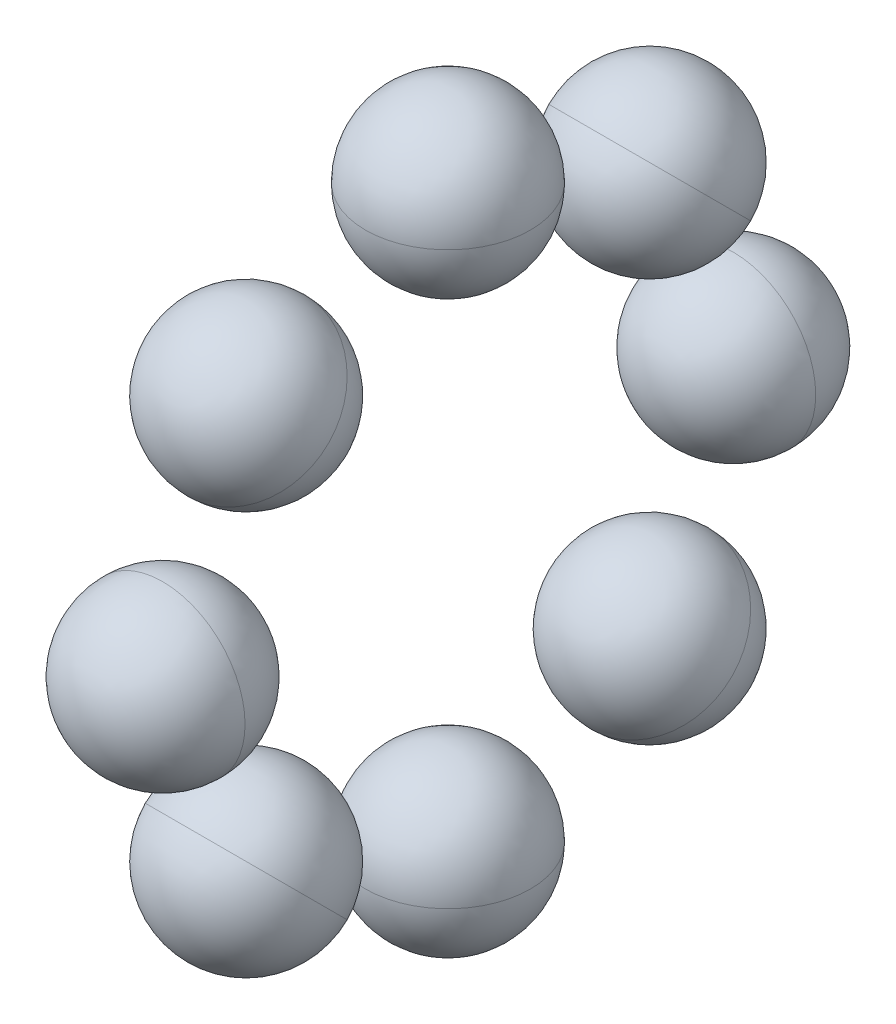
ISO-10303-21;
HEADER;
FILE_DESCRIPTION(('STEP AP214'),'2;1');
FILE_NAME('part.step','',(''),(''),'','','');
FILE_SCHEMA(('AUTOMOTIVE_DESIGN { 1 0 10303 214 1 1 1 1 }'));
ENDSEC;
DATA;
#1=APPLICATION_CONTEXT('core data for automotive mechanical design processes');
#2=APPLICATION_PROTOCOL_DEFINITION('international standard','automotive_design',2000,#1);
#3=PRODUCT_CONTEXT('',#1,'mechanical');
#4=PRODUCT('Part','Part','',(#3));
#5=PRODUCT_RELATED_PRODUCT_CATEGORY('part','',(#4));
#6=PRODUCT_DEFINITION_FORMATION('','',#4);
#7=PRODUCT_DEFINITION_CONTEXT('part definition',#1,'design');
#8=PRODUCT_DEFINITION('design','',#6,#7);
#9=PRODUCT_DEFINITION_SHAPE('','',#8);
#10=(LENGTH_UNIT() NAMED_UNIT(*) SI_UNIT(.MILLI.,.METRE.));
#11=(NAMED_UNIT(*) PLANE_ANGLE_UNIT() SI_UNIT($,.RADIAN.));
#12=(NAMED_UNIT(*) SI_UNIT($,.STERADIAN.) SOLID_ANGLE_UNIT());
#13=UNCERTAINTY_MEASURE_WITH_UNIT(LENGTH_MEASURE(1.E-05),#10,'distance_accuracy_value','');
#14=(GEOMETRIC_REPRESENTATION_CONTEXT(3) GLOBAL_UNCERTAINTY_ASSIGNED_CONTEXT((#13)) GLOBAL_UNIT_ASSIGNED_CONTEXT((#10,
#11,#12)) REPRESENTATION_CONTEXT('',''));
#15=CARTESIAN_POINT('',(0.,0.,0.));
#16=DIRECTION('',(0.,0.,1.));
#17=DIRECTION('',(1.,0.,0.));
#18=AXIS2_PLACEMENT_3D('',#15,#16,#17);
#19=CARTESIAN_POINT('',(0.,6.25,0.));
#20=DIRECTION('',(0.,1.,0.));
#21=DIRECTION('',(1.,0.,0.));
#22=AXIS2_PLACEMENT_3D('',#19,#20,#21);
#23=SPHERICAL_SURFACE('',#22,1.80555555555556);
#24=CARTESIAN_POINT('',(0.,6.25,0.));
#25=DIRECTION('',(0.,1.,0.));
#26=DIRECTION('',(-1.,0.,0.));
#27=AXIS2_PLACEMENT_3D('',#24,#25,#26);
#28=CIRCLE('',#27,1.80555555555556);
#29=CARTESIAN_POINT('',(0.,6.25,-1.80555555555556));
#30=VERTEX_POINT('',#29);
#31=CARTESIAN_POINT('',(0.,6.25,1.80555555555556));
#32=VERTEX_POINT('',#31);
#33=EDGE_CURVE('P0_E11',#30,#32,#28,.T.);
#34=ORIENTED_EDGE('',*,*,#33,.F.);
#35=CARTESIAN_POINT('',(0.,6.25,0.));
#36=DIRECTION('',(0.,-1.,0.));
#37=DIRECTION('',(0.,0.,-1.));
#38=AXIS2_PLACEMENT_3D('',#35,#36,#37);
#39=CIRCLE('',#38,1.80555555555556);
#40=EDGE_CURVE('P0_E25',#30,#32,#39,.T.);
#41=ORIENTED_EDGE('',*,*,#40,.T.);
#42=EDGE_LOOP('',(#34,#41));
#43=FACE_BOUND('',#42,.T.);
#44=ADVANCED_FACE('P0_F16',(#43),#23,.T.);
#45=CARTESIAN_POINT('',(0.,6.25,0.));
#46=DIRECTION('',(0.,1.,0.));
#47=DIRECTION('',(1.,0.,0.));
#48=AXIS2_PLACEMENT_3D('',#45,#46,#47);
#49=SPHERICAL_SURFACE('',#48,1.80555555555556);
#50=ORIENTED_EDGE('',*,*,#40,.F.);
#51=ORIENTED_EDGE('',*,*,#33,.T.);
#52=EDGE_LOOP('',(#50,#51));
#53=FACE_BOUND('',#52,.T.);
#54=ADVANCED_FACE('P0_F40',(#53),#49,.T.);
#55=CLOSED_SHELL('',(#44,#54));
#56=MANIFOLD_SOLID_BREP('P0_B1',#55);
#57=CARTESIAN_POINT('',(0.,4.41941738241592,4.41941738241592));
#58=DIRECTION('',(0.,0.707106781186548,0.707106781186548));
#59=DIRECTION('',(1.,0.,0.));
#60=AXIS2_PLACEMENT_3D('',#57,#58,#59);
#61=SPHERICAL_SURFACE('',#60,1.80555555555556);
#62=CARTESIAN_POINT('',(0.,4.41941738241592,4.41941738241592));
#63=DIRECTION('',(0.,0.707106781186548,0.707106781186548));
#64=DIRECTION('',(0.,-0.707106781186548,0.707106781186548));
#65=AXIS2_PLACEMENT_3D('',#62,#63,#64);
#66=CIRCLE('',#65,1.80555555555556);
#67=CARTESIAN_POINT('',(0.,5.6961379595583,3.14269680527354));
#68=VERTEX_POINT('',#67);
#69=CARTESIAN_POINT('',(0.,3.14269680527354,5.6961379595583));
#70=VERTEX_POINT('',#69);
#71=EDGE_CURVE('P1_E11',#68,#70,#66,.T.);
#72=ORIENTED_EDGE('',*,*,#71,.F.);
#73=CARTESIAN_POINT('',(0.,4.41941738241592,4.41941738241592));
#74=DIRECTION('',(0.,-0.707106781186548,-0.707106781186548));
#75=DIRECTION('',(0.,0.707106781186548,-0.707106781186548));
#76=AXIS2_PLACEMENT_3D('',#73,#74,#75);
#77=CIRCLE('',#76,1.80555555555556);
#78=EDGE_CURVE('P1_E25',#68,#70,#77,.T.);
#79=ORIENTED_EDGE('',*,*,#78,.T.);
#80=EDGE_LOOP('',(#72,#79));
#81=FACE_BOUND('',#80,.T.);
#82=ADVANCED_FACE('P1_F16',(#81),#61,.T.);
#83=CARTESIAN_POINT('',(0.,4.41941738241592,4.41941738241592));
#84=DIRECTION('',(0.,0.707106781186548,0.707106781186548));
#85=DIRECTION('',(1.,0.,0.));
#86=AXIS2_PLACEMENT_3D('',#83,#84,#85);
#87=SPHERICAL_SURFACE('',#86,1.80555555555556);
#88=ORIENTED_EDGE('',*,*,#78,.F.);
#89=ORIENTED_EDGE('',*,*,#71,.T.);
#90=EDGE_LOOP('',(#88,#89));
#91=FACE_BOUND('',#90,.T.);
#92=ADVANCED_FACE('P1_F40',(#91),#87,.T.);
#93=CLOSED_SHELL('',(#82,#92));
#94=MANIFOLD_SOLID_BREP('P1_B1',#93);
#95=CARTESIAN_POINT('',(0.,0.,6.25));
#96=DIRECTION('',(0.,0.,1.));
#97=DIRECTION('',(1.,0.,0.));
#98=AXIS2_PLACEMENT_3D('',#95,#96,#97);
#99=SPHERICAL_SURFACE('',#98,1.80555555555556);
#100=CARTESIAN_POINT('',(0.,0.,6.25));
#101=DIRECTION('',(0.,0.,1.));
#102=DIRECTION('',(1.,0.,0.));
#103=AXIS2_PLACEMENT_3D('',#100,#101,#102);
#104=CIRCLE('',#103,1.80555555555556);
#105=CARTESIAN_POINT('',(0.,1.80555555555556,6.25));
#106=VERTEX_POINT('',#105);
#107=CARTESIAN_POINT('',(0.,-1.80555555555556,6.25));
#108=VERTEX_POINT('',#107);
#109=EDGE_CURVE('P2_E11',#106,#108,#104,.T.);
#110=ORIENTED_EDGE('',*,*,#109,.F.);
#111=CARTESIAN_POINT('',(0.,0.,6.25));
#112=DIRECTION('',(0.,0.,-1.));
#113=DIRECTION('',(-1.,0.,0.));
#114=AXIS2_PLACEMENT_3D('',#111,#112,#113);
#115=CIRCLE('',#114,1.80555555555556);
#116=EDGE_CURVE('P2_E24',#106,#108,#115,.T.);
#117=ORIENTED_EDGE('',*,*,#116,.T.);
#118=EDGE_LOOP('',(#110,#117));
#119=FACE_BOUND('',#118,.T.);
#120=ADVANCED_FACE('P2_F16',(#119),#99,.T.);
#121=CARTESIAN_POINT('',(0.,0.,6.25));
#122=DIRECTION('',(0.,0.,1.));
#123=DIRECTION('',(1.,0.,0.));
#124=AXIS2_PLACEMENT_3D('',#121,#122,#123);
#125=SPHERICAL_SURFACE('',#124,1.80555555555556);
#126=ORIENTED_EDGE('',*,*,#116,.F.);
#127=ORIENTED_EDGE('',*,*,#109,.T.);
#128=EDGE_LOOP('',(#126,#127));
#129=FACE_BOUND('',#128,.T.);
#130=ADVANCED_FACE('P2_F40',(#129),#125,.T.);
#131=CLOSED_SHELL('',(#120,#130));
#132=MANIFOLD_SOLID_BREP('P2_B1',#131);
#133=CARTESIAN_POINT('',(0.,-4.41941738241592,4.41941738241592));
#134=DIRECTION('',(0.,-0.707106781186548,0.707106781186548));
#135=DIRECTION('',(1.,0.,0.));
#136=AXIS2_PLACEMENT_3D('',#133,#134,#135);
#137=SPHERICAL_SURFACE('',#136,1.80555555555556);
#138=CARTESIAN_POINT('',(0.,-4.41941738241592,4.41941738241592));
#139=DIRECTION('',(0.,-0.707106781186548,0.707106781186548));
#140=DIRECTION('',(0.,-0.707106781186548,-0.707106781186548));
#141=AXIS2_PLACEMENT_3D('',#138,#139,#140);
#142=CIRCLE('',#141,1.80555555555556);
#143=CARTESIAN_POINT('',(0.,-3.14269680527354,5.6961379595583));
#144=VERTEX_POINT('',#143);
#145=CARTESIAN_POINT('',(0.,-5.6961379595583,3.14269680527354));
#146=VERTEX_POINT('',#145);
#147=EDGE_CURVE('P3_E11',#144,#146,#142,.T.);
#148=ORIENTED_EDGE('',*,*,#147,.F.);
#149=CARTESIAN_POINT('',(0.,-4.41941738241592,4.41941738241592));
#150=DIRECTION('',(0.,0.707106781186548,-0.707106781186548));
#151=DIRECTION('',(0.,0.707106781186548,0.707106781186548));
#152=AXIS2_PLACEMENT_3D('',#149,#150,#151);
#153=CIRCLE('',#152,1.80555555555556);
#154=EDGE_CURVE('P3_E19',#144,#146,#153,.T.);
#155=ORIENTED_EDGE('',*,*,#154,.T.);
#156=EDGE_LOOP('',(#148,#155));
#157=FACE_BOUND('',#156,.T.);
#158=ADVANCED_FACE('P3_F16',(#157),#137,.T.);
#159=CARTESIAN_POINT('',(0.,-4.41941738241592,4.41941738241592));
#160=DIRECTION('',(0.,-0.707106781186548,0.707106781186548));
#161=DIRECTION('',(1.,0.,0.));
#162=AXIS2_PLACEMENT_3D('',#159,#160,#161);
#163=SPHERICAL_SURFACE('',#162,1.80555555555556);
#164=ORIENTED_EDGE('',*,*,#154,.F.);
#165=ORIENTED_EDGE('',*,*,#147,.T.);
#166=EDGE_LOOP('',(#164,#165));
#167=FACE_BOUND('',#166,.T.);
#168=ADVANCED_FACE('P3_F40',(#167),#163,.T.);
#169=CLOSED_SHELL('',(#158,#168));
#170=MANIFOLD_SOLID_BREP('P3_B1',#169);
#171=CARTESIAN_POINT('',(0.,-6.25,0.));
#172=DIRECTION('',(0.,-1.,0.));
#173=DIRECTION('',(1.,0.,0.));
#174=AXIS2_PLACEMENT_3D('',#171,#172,#173);
#175=SPHERICAL_SURFACE('',#174,1.80555555555556);
#176=CARTESIAN_POINT('',(0.,-6.25,0.));
#177=DIRECTION('',(0.,-1.,0.));
#178=DIRECTION('',(1.,0.,0.));
#179=AXIS2_PLACEMENT_3D('',#176,#177,#178);
#180=CIRCLE('',#179,1.80555555555556);
#181=CARTESIAN_POINT('',(0.,-6.25,1.80555555555556));
#182=VERTEX_POINT('',#181);
#183=CARTESIAN_POINT('',(0.,-6.25,-1.80555555555556));
#184=VERTEX_POINT('',#183);
#185=EDGE_CURVE('P4_E11',#182,#184,#180,.T.);
#186=ORIENTED_EDGE('',*,*,#185,.F.);
#187=CARTESIAN_POINT('',(0.,-6.25,0.));
#188=DIRECTION('',(0.,1.,0.));
#189=DIRECTION('',(0.,0.,1.));
#190=AXIS2_PLACEMENT_3D('',#187,#188,#189);
#191=CIRCLE('',#190,1.80555555555556);
#192=EDGE_CURVE('P4_E20',#182,#184,#191,.T.);
#193=ORIENTED_EDGE('',*,*,#192,.T.);
#194=EDGE_LOOP('',(#186,#193));
#195=FACE_BOUND('',#194,.T.);
#196=ADVANCED_FACE('P4_F16',(#195),#175,.T.);
#197=CARTESIAN_POINT('',(0.,-6.25,0.));
#198=DIRECTION('',(0.,-1.,0.));
#199=DIRECTION('',(1.,0.,0.));
#200=AXIS2_PLACEMENT_3D('',#197,#198,#199);
#201=SPHERICAL_SURFACE('',#200,1.80555555555556);
#202=ORIENTED_EDGE('',*,*,#192,.F.);
#203=ORIENTED_EDGE('',*,*,#185,.T.);
#204=EDGE_LOOP('',(#202,#203));
#205=FACE_BOUND('',#204,.T.);
#206=ADVANCED_FACE('P4_F18',(#205),#201,.T.);
#207=CLOSED_SHELL('',(#196,#206));
#208=MANIFOLD_SOLID_BREP('P4_B1',#207);
#209=CARTESIAN_POINT('',(0.,-4.41941738241592,-4.41941738241592));
#210=DIRECTION('',(0.,-0.707106781186548,-0.707106781186548));
#211=DIRECTION('',(1.,0.,0.));
#212=AXIS2_PLACEMENT_3D('',#209,#210,#211);
#213=SPHERICAL_SURFACE('',#212,1.80555555555556);
#214=CARTESIAN_POINT('',(0.,-4.41941738241592,-4.41941738241592));
#215=DIRECTION('',(0.,-0.707106781186548,-0.707106781186548));
#216=DIRECTION('',(0.,0.707106781186548,-0.707106781186548));
#217=AXIS2_PLACEMENT_3D('',#214,#215,#216);
#218=CIRCLE('',#217,1.80555555555556);
#219=CARTESIAN_POINT('',(0.,-5.6961379595583,-3.14269680527354));
#220=VERTEX_POINT('',#219);
#221=CARTESIAN_POINT('',(0.,-3.14269680527354,-5.6961379595583));
#222=VERTEX_POINT('',#221);
#223=EDGE_CURVE('P5_E11',#220,#222,#218,.T.);
#224=ORIENTED_EDGE('',*,*,#223,.F.);
#225=CARTESIAN_POINT('',(0.,-4.41941738241592,-4.41941738241592));
#226=DIRECTION('',(0.,0.707106781186548,0.707106781186548));
#227=DIRECTION('',(0.,-0.707106781186548,0.707106781186548));
#228=AXIS2_PLACEMENT_3D('',#225,#226,#227);
#229=CIRCLE('',#228,1.80555555555556);
#230=EDGE_CURVE('P5_E24',#220,#222,#229,.T.);
#231=ORIENTED_EDGE('',*,*,#230,.T.);
#232=EDGE_LOOP('',(#224,#231));
#233=FACE_BOUND('',#232,.T.);
#234=ADVANCED_FACE('P5_F16',(#233),#213,.T.);
#235=CARTESIAN_POINT('',(0.,-4.41941738241592,-4.41941738241592));
#236=DIRECTION('',(0.,-0.707106781186548,-0.707106781186548));
#237=DIRECTION('',(1.,0.,0.));
#238=AXIS2_PLACEMENT_3D('',#235,#236,#237);
#239=SPHERICAL_SURFACE('',#238,1.80555555555556);
#240=ORIENTED_EDGE('',*,*,#230,.F.);
#241=ORIENTED_EDGE('',*,*,#223,.T.);
#242=EDGE_LOOP('',(#240,#241));
#243=FACE_BOUND('',#242,.T.);
#244=ADVANCED_FACE('P5_F40',(#243),#239,.T.);
#245=CLOSED_SHELL('',(#234,#244));
#246=MANIFOLD_SOLID_BREP('P5_B1',#245);
#247=CARTESIAN_POINT('',(0.,0.,-6.25));
#248=DIRECTION('',(0.,0.,-1.));
#249=DIRECTION('',(1.,0.,0.));
#250=AXIS2_PLACEMENT_3D('',#247,#248,#249);
#251=SPHERICAL_SURFACE('',#250,1.80555555555556);
#252=CARTESIAN_POINT('',(0.,0.,-6.25));
#253=DIRECTION('',(0.,0.,-1.));
#254=DIRECTION('',(-1.,0.,0.));
#255=AXIS2_PLACEMENT_3D('',#252,#253,#254);
#256=CIRCLE('',#255,1.80555555555556);
#257=CARTESIAN_POINT('',(0.,-1.80555555555556,-6.25));
#258=VERTEX_POINT('',#257);
#259=CARTESIAN_POINT('',(0.,1.80555555555556,-6.25));
#260=VERTEX_POINT('',#259);
#261=EDGE_CURVE('P6_E11',#258,#260,#256,.T.);
#262=ORIENTED_EDGE('',*,*,#261,.F.);
#263=CARTESIAN_POINT('',(0.,0.,-6.25));
#264=DIRECTION('',(0.,0.,1.));
#265=DIRECTION('',(1.,0.,0.));
#266=AXIS2_PLACEMENT_3D('',#263,#264,#265);
#267=CIRCLE('',#266,1.80555555555556);
#268=EDGE_CURVE('P6_E20',#258,#260,#267,.T.);
#269=ORIENTED_EDGE('',*,*,#268,.T.);
#270=EDGE_LOOP('',(#262,#269));
#271=FACE_BOUND('',#270,.T.);
#272=ADVANCED_FACE('P6_F16',(#271),#251,.T.);
#273=CARTESIAN_POINT('',(0.,0.,-6.25));
#274=DIRECTION('',(0.,0.,-1.));
#275=DIRECTION('',(1.,0.,0.));
#276=AXIS2_PLACEMENT_3D('',#273,#274,#275);
#277=SPHERICAL_SURFACE('',#276,1.80555555555556);
#278=ORIENTED_EDGE('',*,*,#268,.F.);
#279=ORIENTED_EDGE('',*,*,#261,.T.);
#280=EDGE_LOOP('',(#278,#279));
#281=FACE_BOUND('',#280,.T.);
#282=ADVANCED_FACE('P6_F18',(#281),#277,.T.);
#283=CLOSED_SHELL('',(#272,#282));
#284=MANIFOLD_SOLID_BREP('P6_B1',#283);
#285=CARTESIAN_POINT('',(0.,4.41941738241592,-4.41941738241592));
#286=DIRECTION('',(0.,0.707106781186547,-0.707106781186548));
#287=DIRECTION('',(1.,0.,0.));
#288=AXIS2_PLACEMENT_3D('',#285,#286,#287);
#289=SPHERICAL_SURFACE('',#288,1.80555555555556);
#290=CARTESIAN_POINT('',(0.,4.41941738241592,-4.41941738241592));
#291=DIRECTION('',(0.,0.707106781186547,-0.707106781186548));
#292=DIRECTION('',(0.,0.707106781186548,0.707106781186547));
#293=AXIS2_PLACEMENT_3D('',#290,#291,#292);
#294=CIRCLE('',#293,1.80555555555556);
#295=CARTESIAN_POINT('',(0.,3.14269680527354,-5.6961379595583));
#296=VERTEX_POINT('',#295);
#297=CARTESIAN_POINT('',(0.,5.6961379595583,-3.14269680527354));
#298=VERTEX_POINT('',#297);
#299=EDGE_CURVE('P7_E11',#296,#298,#294,.T.);
#300=ORIENTED_EDGE('',*,*,#299,.F.);
#301=CARTESIAN_POINT('',(0.,4.41941738241592,-4.41941738241592));
#302=DIRECTION('',(0.,-0.707106781186547,0.707106781186548));
#303=DIRECTION('',(0.,-0.707106781186548,-0.707106781186547));
#304=AXIS2_PLACEMENT_3D('',#301,#302,#303);
#305=CIRCLE('',#304,1.80555555555556);
#306=EDGE_CURVE('P7_E20',#296,#298,#305,.T.);
#307=ORIENTED_EDGE('',*,*,#306,.T.);
#308=EDGE_LOOP('',(#300,#307));
#309=FACE_BOUND('',#308,.T.);
#310=ADVANCED_FACE('P7_F16',(#309),#289,.T.);
#311=CARTESIAN_POINT('',(0.,4.41941738241592,-4.41941738241592));
#312=DIRECTION('',(0.,0.707106781186547,-0.707106781186548));
#313=DIRECTION('',(1.,0.,0.));
#314=AXIS2_PLACEMENT_3D('',#311,#312,#313);
#315=SPHERICAL_SURFACE('',#314,1.80555555555556);
#316=ORIENTED_EDGE('',*,*,#306,.F.);
#317=ORIENTED_EDGE('',*,*,#299,.T.);
#318=EDGE_LOOP('',(#316,#317));
#319=FACE_BOUND('',#318,.T.);
#320=ADVANCED_FACE('P7_F18',(#319),#315,.T.);
#321=CLOSED_SHELL('',(#310,#320));
#322=MANIFOLD_SOLID_BREP('P7_B1',#321);
#323=ADVANCED_BREP_SHAPE_REPRESENTATION('',(#18,#56,#94,#132,#170,#208,#246,#284,#322),#14);
#324=SHAPE_DEFINITION_REPRESENTATION(#9,#323);
ENDSEC;
END-ISO-10303-21;
